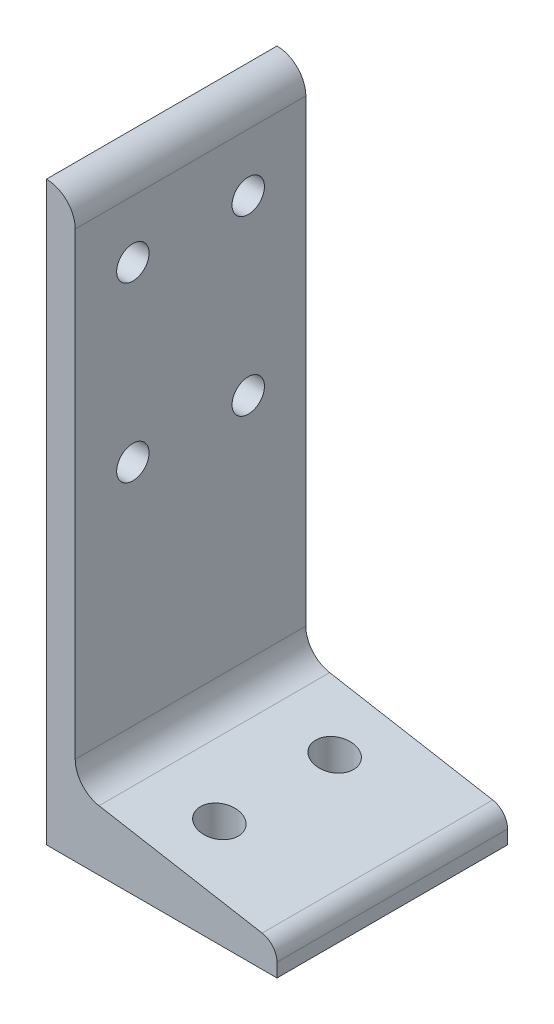
ISO-10303-21;
HEADER;
FILE_DESCRIPTION(('STEP AP214'),'2;1');
FILE_NAME('part.step','',(''),(''),'','','');
FILE_SCHEMA(('AUTOMOTIVE_DESIGN { 1 0 10303 214 1 1 1 1 }'));
ENDSEC;
DATA;
#1=APPLICATION_CONTEXT('core data for automotive mechanical design processes');
#2=APPLICATION_PROTOCOL_DEFINITION('international standard','automotive_design',2000,#1);
#3=PRODUCT_CONTEXT('',#1,'mechanical');
#4=PRODUCT('Part','Part','',(#3));
#5=PRODUCT_RELATED_PRODUCT_CATEGORY('part','',(#4));
#6=PRODUCT_DEFINITION_FORMATION('','',#4);
#7=PRODUCT_DEFINITION_CONTEXT('part definition',#1,'design');
#8=PRODUCT_DEFINITION('design','',#6,#7);
#9=PRODUCT_DEFINITION_SHAPE('','',#8);
#10=(LENGTH_UNIT() NAMED_UNIT(*) SI_UNIT(.MILLI.,.METRE.));
#11=(NAMED_UNIT(*) PLANE_ANGLE_UNIT() SI_UNIT($,.RADIAN.));
#12=(NAMED_UNIT(*) SI_UNIT($,.STERADIAN.) SOLID_ANGLE_UNIT());
#13=UNCERTAINTY_MEASURE_WITH_UNIT(LENGTH_MEASURE(1.E-05),#10,'distance_accuracy_value','');
#14=(GEOMETRIC_REPRESENTATION_CONTEXT(3) GLOBAL_UNCERTAINTY_ASSIGNED_CONTEXT((#13)) GLOBAL_UNIT_ASSIGNED_CONTEXT((#10,
#11,#12)) REPRESENTATION_CONTEXT('',''));
#15=CARTESIAN_POINT('',(0.,0.,0.));
#16=DIRECTION('',(0.,0.,1.));
#17=DIRECTION('',(1.,0.,0.));
#18=AXIS2_PLACEMENT_3D('',#15,#16,#17);
#19=CARTESIAN_POINT('',(-16.3878975119817,-59.0727168406568,50.8));
#20=DIRECTION('',(-1.,0.,0.));
#21=DIRECTION('',(0.,-1.,0.));
#22=AXIS2_PLACEMENT_3D('',#19,#20,#21);
#23=PLANE('',#22);
#24=CARTESIAN_POINT('',(-16.3878975119818,121.648995440178,12.6852380775335));
#25=DIRECTION('',(1.,0.,0.));
#26=DIRECTION('',(0.,1.,0.));
#27=AXIS2_PLACEMENT_3D('',#24,#25,#26);
#28=CIRCLE('',#27,3.56870000000001);
#29=CARTESIAN_POINT('',(-16.3878975119818,125.217695440178,12.6852380775335));
#30=VERTEX_POINT('',#29);
#31=EDGE_CURVE('E174',#30,#30,#28,.T.);
#32=ORIENTED_EDGE('',*,*,#31,.F.);
#33=EDGE_LOOP('',(#32));
#34=FACE_BOUND('',#33,.T.);
#35=CARTESIAN_POINT('',(-16.3878975119817,83.5489782815445,12.6852380775335));
#36=DIRECTION('',(1.,0.,0.));
#37=DIRECTION('',(0.,1.,0.));
#38=AXIS2_PLACEMENT_3D('',#35,#36,#37);
#39=CIRCLE('',#38,3.56869999999999);
#40=CARTESIAN_POINT('',(-16.3878975119817,87.1176782815445,12.6852380775335));
#41=VERTEX_POINT('',#40);
#42=EDGE_CURVE('E190',#41,#41,#39,.T.);
#43=ORIENTED_EDGE('',*,*,#42,.F.);
#44=EDGE_LOOP('',(#43));
#45=FACE_BOUND('',#44,.T.);
#46=CARTESIAN_POINT('',(-16.3878975119817,83.5489782815445,38.1));
#47=DIRECTION('',(1.,0.,0.));
#48=DIRECTION('',(0.,1.,0.));
#49=AXIS2_PLACEMENT_3D('',#46,#47,#48);
#50=CIRCLE('',#49,3.56869999999999);
#51=CARTESIAN_POINT('',(-16.3878975119817,87.1176782815445,38.1));
#52=VERTEX_POINT('',#51);
#53=EDGE_CURVE('E195',#52,#52,#50,.T.);
#54=ORIENTED_EDGE('',*,*,#53,.F.);
#55=EDGE_LOOP('',(#54));
#56=FACE_BOUND('',#55,.T.);
#57=CARTESIAN_POINT('',(-16.3878975119818,121.648978281545,38.1));
#58=DIRECTION('',(1.,0.,0.));
#59=DIRECTION('',(0.,1.,0.));
#60=AXIS2_PLACEMENT_3D('',#57,#58,#59);
#61=CIRCLE('',#60,3.56870000000002);
#62=CARTESIAN_POINT('',(-16.3878975119818,125.217678281545,38.1));
#63=VERTEX_POINT('',#62);
#64=EDGE_CURVE('E201',#63,#63,#61,.T.);
#65=ORIENTED_EDGE('',*,*,#64,.F.);
#66=EDGE_LOOP('',(#65));
#67=FACE_BOUND('',#66,.T.);
#68=DIRECTION('',(0.,1.,0.));
#69=VECTOR('',#68,1.);
#70=CARTESIAN_POINT('',(-16.3878975119817,-59.0727168406568,0.));
#71=LINE('',#70,#69);
#72=CARTESIAN_POINT('',(-16.3878975119817,33.2149952320115,0.));
#73=VERTEX_POINT('',#72);
#74=CARTESIAN_POINT('',(-16.3878975119818,134.348978281545,0.));
#75=VERTEX_POINT('',#74);
#76=EDGE_CURVE('E117',#73,#75,#71,.T.);
#77=ORIENTED_EDGE('',*,*,#76,.T.);
#78=DIRECTION('',(0.,0.,-1.));
#79=VECTOR('',#78,1.);
#80=CARTESIAN_POINT('',(-16.3878975119818,134.348978281545,50.8));
#81=LINE('',#80,#79);
#82=CARTESIAN_POINT('',(-16.3878975119818,134.348978281545,50.8));
#83=VERTEX_POINT('',#82);
#84=EDGE_CURVE('E11',#83,#75,#81,.T.);
#85=ORIENTED_EDGE('',*,*,#84,.F.);
#86=DIRECTION('',(0.,1.,0.));
#87=VECTOR('',#86,1.);
#88=CARTESIAN_POINT('',(-16.3878975119817,-59.0727168406568,50.8));
#89=LINE('',#88,#87);
#90=CARTESIAN_POINT('',(-16.3878975119817,33.2149952320115,50.8));
#91=VERTEX_POINT('',#90);
#92=EDGE_CURVE('E149',#91,#83,#89,.T.);
#93=ORIENTED_EDGE('',*,*,#92,.F.);
#94=DIRECTION('',(0.,0.,-1.));
#95=VECTOR('',#94,1.);
#96=CARTESIAN_POINT('',(-16.3878975119817,33.2149952320115,50.8));
#97=LINE('',#96,#95);
#98=EDGE_CURVE('E34',#91,#73,#97,.T.);
#99=ORIENTED_EDGE('',*,*,#98,.T.);
#100=EDGE_LOOP('',(#77,#85,#93,#99));
#101=FACE_BOUND('',#100,.T.);
#102=ADVANCED_FACE('F16',(#34,#45,#56,#67,#101),#23,.F.);
#103=CARTESIAN_POINT('',(-22.7378975119818,134.348978281545,50.8));
#104=DIRECTION('',(0.,0.,1.));
#105=DIRECTION('',(-1.,0.,0.));
#106=AXIS2_PLACEMENT_3D('',#103,#104,#105);
#107=ELLIPSE('',#106,6.35,6.34999999999999);
#108=DIRECTION('',(0.,0.,-1.));
#109=VECTOR('',#108,1.);
#110=SURFACE_OF_LINEAR_EXTRUSION('',#107,#109);
#111=CARTESIAN_POINT('',(-22.7378975119818,134.348978281545,0.));
#112=DIRECTION('',(0.,0.,1.));
#113=DIRECTION('',(-1.,0.,0.));
#114=AXIS2_PLACEMENT_3D('',#111,#112,#113);
#115=ELLIPSE('',#114,6.35,6.34999999999999);
#116=CARTESIAN_POINT('',(-22.7378975119817,140.698978281545,0.));
#117=VERTEX_POINT('',#116);
#118=EDGE_CURVE('E216',#75,#117,#115,.T.);
#119=ORIENTED_EDGE('',*,*,#118,.T.);
#120=DIRECTION('',(0.,0.,-1.));
#121=VECTOR('',#120,1.);
#122=CARTESIAN_POINT('',(-22.7378975119817,140.698978281545,50.8));
#123=LINE('',#122,#121);
#124=CARTESIAN_POINT('',(-22.7378975119817,140.698978281545,50.8));
#125=VERTEX_POINT('',#124);
#126=EDGE_CURVE('E25',#125,#117,#123,.T.);
#127=ORIENTED_EDGE('',*,*,#126,.F.);
#128=EDGE_CURVE('E73',#83,#125,#107,.T.);
#129=ORIENTED_EDGE('',*,*,#128,.F.);
#130=ORIENTED_EDGE('',*,*,#84,.T.);
#131=EDGE_LOOP('',(#119,#127,#129,#130));
#132=FACE_BOUND('',#131,.T.);
#133=ADVANCED_FACE('F141',(#132),#110,.F.);
#134=CARTESIAN_POINT('',(-22.7378975119817,-59.0727168406568,50.8));
#135=DIRECTION('',(1.,0.,0.));
#136=DIRECTION('',(0.,1.,0.));
#137=AXIS2_PLACEMENT_3D('',#134,#135,#136);
#138=PLANE('',#137);
#139=CARTESIAN_POINT('',(-22.7378975119818,121.648995440178,12.6852380775335));
#140=DIRECTION('',(1.,0.,0.));
#141=DIRECTION('',(0.,1.,0.));
#142=AXIS2_PLACEMENT_3D('',#139,#140,#141);
#143=CIRCLE('',#142,3.56870000000001);
#144=CARTESIAN_POINT('',(-22.7378975119818,125.217695440178,12.6852380775335));
#145=VERTEX_POINT('',#144);
#146=EDGE_CURVE('E179',#145,#145,#143,.T.);
#147=ORIENTED_EDGE('',*,*,#146,.T.);
#148=EDGE_LOOP('',(#147));
#149=FACE_BOUND('',#148,.T.);
#150=CARTESIAN_POINT('',(-22.7378975119818,83.5489782815445,12.6852380775335));
#151=DIRECTION('',(1.,0.,0.));
#152=DIRECTION('',(0.,1.,0.));
#153=AXIS2_PLACEMENT_3D('',#150,#151,#152);
#154=CIRCLE('',#153,3.56869999999999);
#155=CARTESIAN_POINT('',(-22.7378975119818,87.1176782815445,12.6852380775335));
#156=VERTEX_POINT('',#155);
#157=EDGE_CURVE('E192',#156,#156,#154,.T.);
#158=ORIENTED_EDGE('',*,*,#157,.T.);
#159=EDGE_LOOP('',(#158));
#160=FACE_BOUND('',#159,.T.);
#161=CARTESIAN_POINT('',(-22.7378975119818,83.5489782815445,38.1));
#162=DIRECTION('',(1.,0.,0.));
#163=DIRECTION('',(0.,1.,0.));
#164=AXIS2_PLACEMENT_3D('',#161,#162,#163);
#165=CIRCLE('',#164,3.56869999999999);
#166=CARTESIAN_POINT('',(-22.7378975119818,87.1176782815445,38.1));
#167=VERTEX_POINT('',#166);
#168=EDGE_CURVE('E198',#167,#167,#165,.T.);
#169=ORIENTED_EDGE('',*,*,#168,.T.);
#170=EDGE_LOOP('',(#169));
#171=FACE_BOUND('',#170,.T.);
#172=CARTESIAN_POINT('',(-22.7378975119818,121.648978281545,38.1));
#173=DIRECTION('',(1.,0.,0.));
#174=DIRECTION('',(0.,1.,0.));
#175=AXIS2_PLACEMENT_3D('',#172,#173,#174);
#176=CIRCLE('',#175,3.56870000000002);
#177=CARTESIAN_POINT('',(-22.7378975119818,125.217678281545,38.1));
#178=VERTEX_POINT('',#177);
#179=EDGE_CURVE('E204',#178,#178,#176,.T.);
#180=ORIENTED_EDGE('',*,*,#179,.T.);
#181=EDGE_LOOP('',(#180));
#182=FACE_BOUND('',#181,.T.);
#183=DIRECTION('',(0.,-1.,0.));
#184=VECTOR('',#183,1.);
#185=CARTESIAN_POINT('',(-22.7378975119817,-59.0727168406568,0.));
#186=LINE('',#185,#184);
#187=CARTESIAN_POINT('',(-22.7378975119817,13.6989782815445,0.));
#188=VERTEX_POINT('',#187);
#189=EDGE_CURVE('E217',#117,#188,#186,.T.);
#190=ORIENTED_EDGE('',*,*,#189,.T.);
#191=DIRECTION('',(0.,0.,-1.));
#192=VECTOR('',#191,1.);
#193=CARTESIAN_POINT('',(-22.7378975119817,13.6989782815445,50.8));
#194=LINE('',#193,#192);
#195=CARTESIAN_POINT('',(-22.7378975119817,13.6989782815445,50.8));
#196=VERTEX_POINT('',#195);
#197=EDGE_CURVE('E164',#196,#188,#194,.T.);
#198=ORIENTED_EDGE('',*,*,#197,.F.);
#199=DIRECTION('',(0.,-1.,0.));
#200=VECTOR('',#199,1.);
#201=CARTESIAN_POINT('',(-22.7378975119817,-59.0727168406568,50.8));
#202=LINE('',#201,#200);
#203=EDGE_CURVE('E148',#125,#196,#202,.T.);
#204=ORIENTED_EDGE('',*,*,#203,.F.);
#205=ORIENTED_EDGE('',*,*,#126,.T.);
#206=EDGE_LOOP('',(#190,#198,#204,#205));
#207=FACE_BOUND('',#206,.T.);
#208=ADVANCED_FACE('F138',(#149,#160,#171,#182,#207),#138,.F.);
#209=CARTESIAN_POINT('',(-12.9149361595296,13.6989782815445,50.8));
#210=DIRECTION('',(0.,1.,0.));
#211=DIRECTION('',(-1.,0.,0.));
#212=AXIS2_PLACEMENT_3D('',#209,#210,#211);
#213=PLANE('',#212);
#214=CARTESIAN_POINT('',(2.66210248801829,13.6989782815445,38.1));
#215=DIRECTION('',(0.,-1.,0.));
#216=DIRECTION('',(1.,0.,0.));
#217=AXIS2_PLACEMENT_3D('',#214,#215,#216);
#218=CIRCLE('',#217,4.1656);
#219=CARTESIAN_POINT('',(6.82770248801829,13.6989782815445,38.1));
#220=VERTEX_POINT('',#219);
#221=EDGE_CURVE('E186',#220,#220,#218,.T.);
#222=ORIENTED_EDGE('',*,*,#221,.F.);
#223=EDGE_LOOP('',(#222));
#224=FACE_BOUND('',#223,.T.);
#225=CARTESIAN_POINT('',(2.66210248801829,13.6989782815445,12.7));
#226=DIRECTION('',(0.,-1.,0.));
#227=DIRECTION('',(1.,0.,0.));
#228=AXIS2_PLACEMENT_3D('',#225,#226,#227);
#229=CIRCLE('',#228,4.1656);
#230=CARTESIAN_POINT('',(6.82770248801829,13.6989782815445,12.7));
#231=VERTEX_POINT('',#230);
#232=EDGE_CURVE('E175',#231,#231,#229,.T.);
#233=ORIENTED_EDGE('',*,*,#232,.F.);
#234=EDGE_LOOP('',(#233));
#235=FACE_BOUND('',#234,.T.);
#236=DIRECTION('',(1.,0.,0.));
#237=VECTOR('',#236,1.);
#238=CARTESIAN_POINT('',(-12.9149361595296,13.6989782815445,0.));
#239=LINE('',#238,#237);
#240=CARTESIAN_POINT('',(28.0621024880183,13.6989782815445,0.));
#241=VERTEX_POINT('',#240);
#242=EDGE_CURVE('E162',#188,#241,#239,.T.);
#243=ORIENTED_EDGE('',*,*,#242,.T.);
#244=DIRECTION('',(0.,0.,-1.));
#245=VECTOR('',#244,1.);
#246=CARTESIAN_POINT('',(28.0621024880183,13.6989782815445,50.8));
#247=LINE('',#246,#245);
#248=CARTESIAN_POINT('',(28.0621024880183,13.6989782815445,50.8));
#249=VERTEX_POINT('',#248);
#250=EDGE_CURVE('E160',#249,#241,#247,.T.);
#251=ORIENTED_EDGE('',*,*,#250,.F.);
#252=DIRECTION('',(1.,0.,0.));
#253=VECTOR('',#252,1.);
#254=CARTESIAN_POINT('',(-12.9149361595296,13.6989782815445,50.8));
#255=LINE('',#254,#253);
#256=EDGE_CURVE('E152',#196,#249,#255,.T.);
#257=ORIENTED_EDGE('',*,*,#256,.F.);
#258=ORIENTED_EDGE('',*,*,#197,.T.);
#259=EDGE_LOOP('',(#243,#251,#257,#258));
#260=FACE_BOUND('',#259,.T.);
#261=ADVANCED_FACE('F134',(#224,#235,#260),#213,.F.);
#262=CARTESIAN_POINT('',(28.0621024880184,-59.0727168406568,50.8));
#263=DIRECTION('',(-1.,0.,0.));
#264=DIRECTION('',(0.,-1.,0.));
#265=AXIS2_PLACEMENT_3D('',#262,#263,#264);
#266=PLANE('',#265);
#267=DIRECTION('',(0.,1.,0.));
#268=VECTOR('',#267,1.);
#269=CARTESIAN_POINT('',(28.0621024880184,-59.0727168406568,0.));
#270=LINE('',#269,#268);
#271=CARTESIAN_POINT('',(28.0621024880183,16.7241299029677,0.));
#272=VERTEX_POINT('',#271);
#273=EDGE_CURVE('E166',#241,#272,#270,.T.);
#274=ORIENTED_EDGE('',*,*,#273,.T.);
#275=DIRECTION('',(0.,0.,-1.));
#276=VECTOR('',#275,1.);
#277=CARTESIAN_POINT('',(28.0621024880183,16.7241299029677,50.8));
#278=LINE('',#277,#276);
#279=CARTESIAN_POINT('',(28.0621024880183,16.7241299029677,50.8));
#280=VERTEX_POINT('',#279);
#281=EDGE_CURVE('E107',#280,#272,#278,.T.);
#282=ORIENTED_EDGE('',*,*,#281,.F.);
#283=DIRECTION('',(0.,1.,0.));
#284=VECTOR('',#283,1.);
#285=CARTESIAN_POINT('',(28.0621024880184,-59.0727168406568,50.8));
#286=LINE('',#285,#284);
#287=EDGE_CURVE('E95',#249,#280,#286,.T.);
#288=ORIENTED_EDGE('',*,*,#287,.F.);
#289=ORIENTED_EDGE('',*,*,#250,.T.);
#290=EDGE_LOOP('',(#274,#282,#288,#289));
#291=FACE_BOUND('',#290,.T.);
#292=ADVANCED_FACE('F131',(#291),#266,.F.);
#293=CARTESIAN_POINT('',(24.0997024880183,16.7241299029677,50.8));
#294=DIRECTION('',(0.,0.,1.));
#295=DIRECTION('',(1.,0.,0.));
#296=AXIS2_PLACEMENT_3D('',#293,#294,#295);
#297=ELLIPSE('',#296,3.9624,3.9624);
#298=DIRECTION('',(0.,0.,-1.));
#299=VECTOR('',#298,1.);
#300=SURFACE_OF_LINEAR_EXTRUSION('',#297,#299);
#301=CARTESIAN_POINT('',(24.0997024880183,16.7241299029677,0.));
#302=DIRECTION('',(0.,0.,1.));
#303=DIRECTION('',(1.,0.,0.));
#304=AXIS2_PLACEMENT_3D('',#301,#302,#303);
#305=ELLIPSE('',#304,3.9624,3.9624);
#306=CARTESIAN_POINT('',(24.7877660272057,20.6263321435033,0.));
#307=VERTEX_POINT('',#306);
#308=EDGE_CURVE('E104',#272,#307,#305,.T.);
#309=ORIENTED_EDGE('',*,*,#308,.T.);
#310=DIRECTION('',(0.,0.,-1.));
#311=VECTOR('',#310,1.);
#312=CARTESIAN_POINT('',(24.7877660272057,20.6263321435033,50.8));
#313=LINE('',#312,#311);
#314=CARTESIAN_POINT('',(24.7877660272057,20.6263321435033,50.8));
#315=VERTEX_POINT('',#314);
#316=EDGE_CURVE('E101',#315,#307,#313,.T.);
#317=ORIENTED_EDGE('',*,*,#316,.F.);
#318=EDGE_CURVE('E88',#280,#315,#297,.T.);
#319=ORIENTED_EDGE('',*,*,#318,.F.);
#320=ORIENTED_EDGE('',*,*,#281,.T.);
#321=EDGE_LOOP('',(#309,#317,#319,#320));
#322=FACE_BOUND('',#321,.T.);
#323=ADVANCED_FACE('F102',(#322),#300,.F.);
#324=CARTESIAN_POINT('',(1.85127949779703,24.6706535612943,50.8));
#325=DIRECTION('',(-0.17364817766693,-0.984807753012208,0.));
#326=DIRECTION('',(0.984807753012208,-0.17364817766693,0.));
#327=AXIS2_PLACEMENT_3D('',#324,#325,#326);
#328=PLANE('',#327);
#329=CARTESIAN_POINT('',(2.66210248801829,24.5276835915395,38.1));
#330=DIRECTION('',(-0.17364817766693,-0.984807753012208,0.));
#331=DIRECTION('',(0.984807753012208,-0.17364817766693,0.));
#332=AXIS2_PLACEMENT_3D('',#329,#330,#331);
#333=ELLIPSE('',#332,4.22986109447126,4.1656);
#334=CARTESIAN_POINT('',(6.82770248801829,23.7931759207004,38.1));
#335=VERTEX_POINT('',#334);
#336=EDGE_CURVE('E19',#335,#335,#333,.T.);
#337=ORIENTED_EDGE('',*,*,#336,.T.);
#338=EDGE_LOOP('',(#337));
#339=FACE_BOUND('',#338,.T.);
#340=CARTESIAN_POINT('',(2.66210248801829,24.5276835915395,12.7));
#341=DIRECTION('',(-0.17364817766693,-0.984807753012208,0.));
#342=DIRECTION('',(0.984807753012208,-0.17364817766693,0.));
#343=AXIS2_PLACEMENT_3D('',#340,#341,#342);
#344=ELLIPSE('',#343,4.22986109447126,4.1656);
#345=CARTESIAN_POINT('',(6.82770248801829,23.7931759207004,12.7));
#346=VERTEX_POINT('',#345);
#347=EDGE_CURVE('E172',#346,#346,#344,.T.);
#348=ORIENTED_EDGE('',*,*,#347,.T.);
#349=EDGE_LOOP('',(#348));
#350=FACE_BOUND('',#349,.T.);
#351=DIRECTION('',(-0.984807753012208,0.17364817766693,0.));
#352=VECTOR('',#351,1.);
#353=CARTESIAN_POINT('',(1.85127949779703,24.6706535612943,0.));
#354=LINE('',#353,#352);
#355=CARTESIAN_POINT('',(-11.1405634401667,26.961466000384,0.));
#356=VERTEX_POINT('',#355);
#357=EDGE_CURVE('E223',#307,#356,#354,.T.);
#358=ORIENTED_EDGE('',*,*,#357,.T.);
#359=DIRECTION('',(0.,0.,-1.));
#360=VECTOR('',#359,1.);
#361=CARTESIAN_POINT('',(-11.1405634401667,26.961466000384,50.8));
#362=LINE('',#361,#360);
#363=CARTESIAN_POINT('',(-11.1405634401667,26.961466000384,50.8));
#364=VERTEX_POINT('',#363);
#365=EDGE_CURVE('E61',#364,#356,#362,.T.);
#366=ORIENTED_EDGE('',*,*,#365,.F.);
#367=DIRECTION('',(-0.984807753012208,0.17364817766693,0.));
#368=VECTOR('',#367,1.);
#369=CARTESIAN_POINT('',(1.85127949779703,24.6706535612943,50.8));
#370=LINE('',#369,#368);
#371=EDGE_CURVE('E93',#315,#364,#370,.T.);
#372=ORIENTED_EDGE('',*,*,#371,.F.);
#373=ORIENTED_EDGE('',*,*,#316,.T.);
#374=EDGE_LOOP('',(#358,#366,#372,#373));
#375=FACE_BOUND('',#374,.T.);
#376=ADVANCED_FACE('F109',(#339,#350,#375),#328,.F.);
#377=CARTESIAN_POINT('',(-10.0378975119817,33.2149952320115,50.8));
#378=DIRECTION('',(0.,0.,1.));
#379=DIRECTION('',(0.,1.,0.));
#380=AXIS2_PLACEMENT_3D('',#377,#378,#379);
#381=ELLIPSE('',#380,6.35,6.35);
#382=DIRECTION('',(0.,0.,-1.));
#383=VECTOR('',#382,1.);
#384=SURFACE_OF_LINEAR_EXTRUSION('',#381,#383);
#385=CARTESIAN_POINT('',(-10.0378975119817,33.2149952320115,0.));
#386=DIRECTION('',(0.,0.,1.));
#387=DIRECTION('',(0.,1.,0.));
#388=AXIS2_PLACEMENT_3D('',#385,#386,#387);
#389=ELLIPSE('',#388,6.35,6.35);
#390=EDGE_CURVE('E225',#73,#356,#389,.T.);
#391=ORIENTED_EDGE('',*,*,#390,.F.);
#392=ORIENTED_EDGE('',*,*,#98,.F.);
#393=EDGE_CURVE('E110',#91,#364,#381,.T.);
#394=ORIENTED_EDGE('',*,*,#393,.T.);
#395=ORIENTED_EDGE('',*,*,#365,.T.);
#396=EDGE_LOOP('',(#391,#392,#394,#395));
#397=FACE_BOUND('',#396,.T.);
#398=ADVANCED_FACE('F120',(#397),#384,.T.);
#399=CARTESIAN_POINT('',(-12.9149361595296,-59.0727168406568,50.8));
#400=DIRECTION('',(0.,0.,1.));
#401=DIRECTION('',(1.,0.,0.));
#402=AXIS2_PLACEMENT_3D('',#399,#400,#401);
#403=PLANE('',#402);
#404=ORIENTED_EDGE('',*,*,#92,.T.);
#405=ORIENTED_EDGE('',*,*,#128,.T.);
#406=ORIENTED_EDGE('',*,*,#203,.T.);
#407=ORIENTED_EDGE('',*,*,#256,.T.);
#408=ORIENTED_EDGE('',*,*,#287,.T.);
#409=ORIENTED_EDGE('',*,*,#318,.T.);
#410=ORIENTED_EDGE('',*,*,#371,.T.);
#411=ORIENTED_EDGE('',*,*,#393,.F.);
#412=EDGE_LOOP('',(#404,#405,#406,#407,#408,#409,#410,#411));
#413=FACE_BOUND('',#412,.T.);
#414=ADVANCED_FACE('F90',(#413),#403,.T.);
#415=CARTESIAN_POINT('',(-12.9149361595296,-59.0727168406568,0.));
#416=DIRECTION('',(0.,0.,1.));
#417=DIRECTION('',(1.,0.,0.));
#418=AXIS2_PLACEMENT_3D('',#415,#416,#417);
#419=PLANE('',#418);
#420=ORIENTED_EDGE('',*,*,#76,.F.);
#421=ORIENTED_EDGE('',*,*,#390,.T.);
#422=ORIENTED_EDGE('',*,*,#357,.F.);
#423=ORIENTED_EDGE('',*,*,#308,.F.);
#424=ORIENTED_EDGE('',*,*,#273,.F.);
#425=ORIENTED_EDGE('',*,*,#242,.F.);
#426=ORIENTED_EDGE('',*,*,#189,.F.);
#427=ORIENTED_EDGE('',*,*,#118,.F.);
#428=EDGE_LOOP('',(#420,#421,#422,#423,#424,#425,#426,#427));
#429=FACE_BOUND('',#428,.T.);
#430=ADVANCED_FACE('F124',(#429),#419,.F.);
#431=CARTESIAN_POINT('',(-22.7378975119818,121.648978281545,38.1));
#432=DIRECTION('',(1.,0.,0.));
#433=DIRECTION('',(0.,1.,0.));
#434=AXIS2_PLACEMENT_3D('',#431,#432,#433);
#435=CYLINDRICAL_SURFACE('',#434,3.56870000000002);
#436=ORIENTED_EDGE('',*,*,#179,.F.);
#437=EDGE_LOOP('',(#436));
#438=FACE_BOUND('',#437,.T.);
#439=ORIENTED_EDGE('',*,*,#64,.T.);
#440=EDGE_LOOP('',(#439));
#441=FACE_BOUND('',#440,.T.);
#442=ADVANCED_FACE('F209',(#438,#441),#435,.F.);
#443=CARTESIAN_POINT('',(-22.7378975119818,83.5489782815445,38.1));
#444=DIRECTION('',(1.,0.,0.));
#445=DIRECTION('',(0.,1.,0.));
#446=AXIS2_PLACEMENT_3D('',#443,#444,#445);
#447=CYLINDRICAL_SURFACE('',#446,3.56869999999999);
#448=ORIENTED_EDGE('',*,*,#168,.F.);
#449=EDGE_LOOP('',(#448));
#450=FACE_BOUND('',#449,.T.);
#451=ORIENTED_EDGE('',*,*,#53,.T.);
#452=EDGE_LOOP('',(#451));
#453=FACE_BOUND('',#452,.T.);
#454=ADVANCED_FACE('F236',(#450,#453),#447,.F.);
#455=CARTESIAN_POINT('',(-22.7378975119818,83.5489782815445,12.6852380775335));
#456=DIRECTION('',(1.,0.,0.));
#457=DIRECTION('',(0.,1.,0.));
#458=AXIS2_PLACEMENT_3D('',#455,#456,#457);
#459=CYLINDRICAL_SURFACE('',#458,3.56869999999999);
#460=ORIENTED_EDGE('',*,*,#157,.F.);
#461=EDGE_LOOP('',(#460));
#462=FACE_BOUND('',#461,.T.);
#463=ORIENTED_EDGE('',*,*,#42,.T.);
#464=EDGE_LOOP('',(#463));
#465=FACE_BOUND('',#464,.T.);
#466=ADVANCED_FACE('F245',(#462,#465),#459,.F.);
#467=CARTESIAN_POINT('',(-22.7378975119818,121.648995440178,12.6852380775335));
#468=DIRECTION('',(1.,0.,0.));
#469=DIRECTION('',(0.,1.,0.));
#470=AXIS2_PLACEMENT_3D('',#467,#468,#469);
#471=CYLINDRICAL_SURFACE('',#470,3.56870000000001);
#472=ORIENTED_EDGE('',*,*,#146,.F.);
#473=EDGE_LOOP('',(#472));
#474=FACE_BOUND('',#473,.T.);
#475=ORIENTED_EDGE('',*,*,#31,.T.);
#476=EDGE_LOOP('',(#475));
#477=FACE_BOUND('',#476,.T.);
#478=ADVANCED_FACE('F249',(#474,#477),#471,.F.);
#479=CARTESIAN_POINT('',(2.66210248801824,140.698978281545,12.7));
#480=DIRECTION('',(0.,-1.,0.));
#481=DIRECTION('',(1.,0.,0.));
#482=AXIS2_PLACEMENT_3D('',#479,#480,#481);
#483=CYLINDRICAL_SURFACE('',#482,4.1656);
#484=ORIENTED_EDGE('',*,*,#232,.T.);
#485=EDGE_LOOP('',(#484));
#486=FACE_BOUND('',#485,.T.);
#487=ORIENTED_EDGE('',*,*,#347,.F.);
#488=EDGE_LOOP('',(#487));
#489=FACE_BOUND('',#488,.T.);
#490=ADVANCED_FACE('F253',(#486,#489),#483,.F.);
#491=CARTESIAN_POINT('',(2.66210248801824,140.698978281545,38.1));
#492=DIRECTION('',(0.,-1.,0.));
#493=DIRECTION('',(1.,0.,0.));
#494=AXIS2_PLACEMENT_3D('',#491,#492,#493);
#495=CYLINDRICAL_SURFACE('',#494,4.1656);
#496=ORIENTED_EDGE('',*,*,#221,.T.);
#497=EDGE_LOOP('',(#496));
#498=FACE_BOUND('',#497,.T.);
#499=ORIENTED_EDGE('',*,*,#336,.F.);
#500=EDGE_LOOP('',(#499));
#501=FACE_BOUND('',#500,.T.);
#502=ADVANCED_FACE('F257',(#498,#501),#495,.F.);
#503=CLOSED_SHELL('',(#102,#133,#208,#261,#292,#323,#376,#398,#414,#430,#442,#454,#466,#478,
#490,#502));
#504=MANIFOLD_SOLID_BREP('B1',#503);
#505=ADVANCED_BREP_SHAPE_REPRESENTATION('',(#18,#504),#14);
#506=SHAPE_DEFINITION_REPRESENTATION(#9,#505);
ENDSEC;
END-ISO-10303-21;
